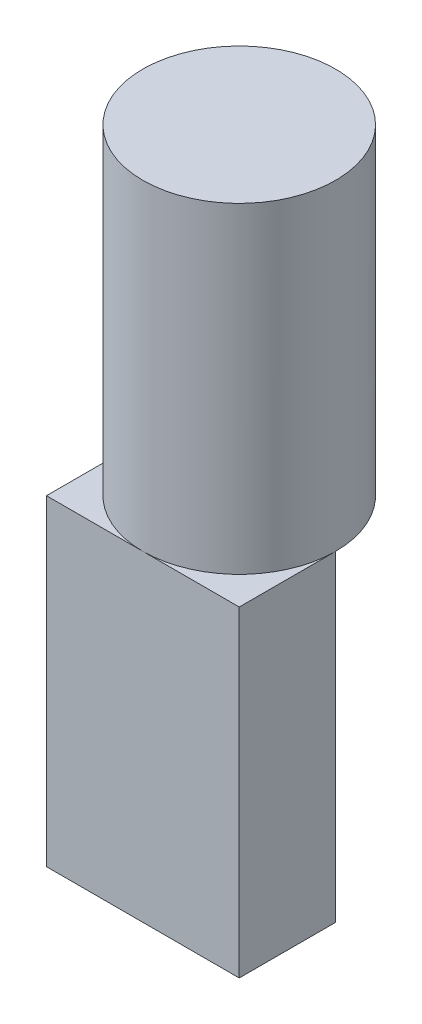
ISO-10303-21;
HEADER;
FILE_DESCRIPTION(('STEP AP214'),'2;1');
FILE_NAME('part.step','',(''),(''),'','','');
FILE_SCHEMA(('AUTOMOTIVE_DESIGN { 1 0 10303 214 1 1 1 1 }'));
ENDSEC;
DATA;
#1=APPLICATION_CONTEXT('core data for automotive mechanical design processes');
#2=APPLICATION_PROTOCOL_DEFINITION('international standard','automotive_design',2000,#1);
#3=PRODUCT_CONTEXT('',#1,'mechanical');
#4=PRODUCT('Part','Part','',(#3));
#5=PRODUCT_RELATED_PRODUCT_CATEGORY('part','',(#4));
#6=PRODUCT_DEFINITION_FORMATION('','',#4);
#7=PRODUCT_DEFINITION_CONTEXT('part definition',#1,'design');
#8=PRODUCT_DEFINITION('design','',#6,#7);
#9=PRODUCT_DEFINITION_SHAPE('','',#8);
#10=(LENGTH_UNIT() NAMED_UNIT(*) SI_UNIT(.MILLI.,.METRE.));
#11=(NAMED_UNIT(*) PLANE_ANGLE_UNIT() SI_UNIT($,.RADIAN.));
#12=(NAMED_UNIT(*) SI_UNIT($,.STERADIAN.) SOLID_ANGLE_UNIT());
#13=UNCERTAINTY_MEASURE_WITH_UNIT(LENGTH_MEASURE(1.E-05),#10,'distance_accuracy_value','');
#14=(GEOMETRIC_REPRESENTATION_CONTEXT(3) GLOBAL_UNCERTAINTY_ASSIGNED_CONTEXT((#13)) GLOBAL_UNIT_ASSIGNED_CONTEXT((#10,
#11,#12)) REPRESENTATION_CONTEXT('',''));
#15=CARTESIAN_POINT('',(0.,0.,0.));
#16=DIRECTION('',(0.,0.,1.));
#17=DIRECTION('',(1.,0.,0.));
#18=AXIS2_PLACEMENT_3D('',#15,#16,#17);
#19=CARTESIAN_POINT('',(0.,0.,0.));
#20=DIRECTION('',(0.,1.,0.));
#21=DIRECTION('',(0.,0.,1.));
#22=AXIS2_PLACEMENT_3D('',#19,#20,#21);
#23=PLANE('',#22);
#24=DIRECTION('',(1.,0.,0.));
#25=VECTOR('',#24,1.);
#26=CARTESIAN_POINT('',(-3.,0.,0.));
#27=LINE('',#26,#25);
#28=CARTESIAN_POINT('',(-3.,0.,0.));
#29=VERTEX_POINT('',#28);
#30=CARTESIAN_POINT('',(3.,0.,0.));
#31=VERTEX_POINT('',#30);
#32=EDGE_CURVE('E47',#29,#31,#27,.T.);
#33=ORIENTED_EDGE('',*,*,#32,.F.);
#34=CARTESIAN_POINT('',(0.,0.,0.));
#35=DIRECTION('',(0.,1.,0.));
#36=DIRECTION('',(0.,0.,1.));
#37=AXIS2_PLACEMENT_3D('',#34,#35,#36);
#38=CIRCLE('',#37,3.);
#39=EDGE_CURVE('E104',#31,#29,#38,.T.);
#40=ORIENTED_EDGE('',*,*,#39,.F.);
#41=EDGE_LOOP('',(#33,#40));
#42=FACE_BOUND('',#41,.T.);
#43=ADVANCED_FACE('F33',(#42),#23,.F.);
#44=CARTESIAN_POINT('',(0.,10.,0.));
#45=DIRECTION('',(0.,-1.,0.));
#46=DIRECTION('',(0.,0.,-1.));
#47=AXIS2_PLACEMENT_3D('',#44,#45,#46);
#48=CYLINDRICAL_SURFACE('',#47,3.);
#49=CARTESIAN_POINT('',(0.,10.,0.));
#50=DIRECTION('',(0.,1.,0.));
#51=DIRECTION('',(0.,0.,1.));
#52=AXIS2_PLACEMENT_3D('',#49,#50,#51);
#53=CIRCLE('',#52,3.);
#54=CARTESIAN_POINT('',(0.,10.,3.));
#55=VERTEX_POINT('',#54);
#56=EDGE_CURVE('E11',#55,#55,#53,.T.);
#57=ORIENTED_EDGE('',*,*,#56,.F.);
#58=EDGE_LOOP('',(#57));
#59=FACE_BOUND('',#58,.T.);
#60=CARTESIAN_POINT('',(0.,0.,3.));
#61=VERTEX_POINT('',#60);
#62=EDGE_CURVE('E37',#61,#31,#38,.T.);
#63=ORIENTED_EDGE('',*,*,#62,.T.);
#64=ORIENTED_EDGE('',*,*,#39,.T.);
#65=EDGE_CURVE('E54',#29,#61,#38,.T.);
#66=ORIENTED_EDGE('',*,*,#65,.T.);
#67=EDGE_LOOP('',(#63,#64,#66));
#68=FACE_BOUND('',#67,.T.);
#69=ADVANCED_FACE('F35',(#59,#68),#48,.T.);
#70=CARTESIAN_POINT('',(0.,10.,0.));
#71=DIRECTION('',(0.,1.,0.));
#72=DIRECTION('',(0.,0.,1.));
#73=AXIS2_PLACEMENT_3D('',#70,#71,#72);
#74=PLANE('',#73);
#75=ORIENTED_EDGE('',*,*,#56,.T.);
#76=EDGE_LOOP('',(#75));
#77=FACE_BOUND('',#76,.T.);
#78=ADVANCED_FACE('F136',(#77),#74,.T.);
#79=CARTESIAN_POINT('',(0.,0.,0.));
#80=DIRECTION('',(0.,-1.,0.));
#81=DIRECTION('',(0.,0.,-1.));
#82=AXIS2_PLACEMENT_3D('',#79,#80,#81);
#83=PLANE('',#82);
#84=ORIENTED_EDGE('',*,*,#62,.F.);
#85=DIRECTION('',(-1.,0.,0.));
#86=VECTOR('',#85,1.);
#87=CARTESIAN_POINT('',(3.,0.,3.));
#88=LINE('',#87,#86);
#89=CARTESIAN_POINT('',(3.,0.,3.));
#90=VERTEX_POINT('',#89);
#91=EDGE_CURVE('E98',#90,#61,#88,.T.);
#92=ORIENTED_EDGE('',*,*,#91,.F.);
#93=DIRECTION('',(0.,0.,1.));
#94=VECTOR('',#93,1.);
#95=CARTESIAN_POINT('',(3.,0.,0.));
#96=LINE('',#95,#94);
#97=EDGE_CURVE('E115',#31,#90,#96,.T.);
#98=ORIENTED_EDGE('',*,*,#97,.F.);
#99=EDGE_LOOP('',(#84,#92,#98));
#100=FACE_BOUND('',#99,.T.);
#101=ADVANCED_FACE('F131',(#100),#83,.F.);
#102=CARTESIAN_POINT('',(-3.,-10.,3.));
#103=DIRECTION('',(1.,0.,0.));
#104=DIRECTION('',(0.,0.,-1.));
#105=AXIS2_PLACEMENT_3D('',#102,#103,#104);
#106=PLANE('',#105);
#107=DIRECTION('',(0.,0.,-1.));
#108=VECTOR('',#107,1.);
#109=CARTESIAN_POINT('',(-3.,0.,3.));
#110=LINE('',#109,#108);
#111=CARTESIAN_POINT('',(-3.,0.,3.));
#112=VERTEX_POINT('',#111);
#113=EDGE_CURVE('E102',#112,#29,#110,.T.);
#114=ORIENTED_EDGE('',*,*,#113,.T.);
#115=DIRECTION('',(0.,1.,0.));
#116=VECTOR('',#115,1.);
#117=CARTESIAN_POINT('',(-3.,-10.,0.));
#118=LINE('',#117,#116);
#119=CARTESIAN_POINT('',(-3.,-10.,0.));
#120=VERTEX_POINT('',#119);
#121=EDGE_CURVE('E82',#120,#29,#118,.T.);
#122=ORIENTED_EDGE('',*,*,#121,.F.);
#123=DIRECTION('',(0.,0.,-1.));
#124=VECTOR('',#123,1.);
#125=CARTESIAN_POINT('',(-3.,-10.,3.));
#126=LINE('',#125,#124);
#127=CARTESIAN_POINT('',(-3.,-10.,3.));
#128=VERTEX_POINT('',#127);
#129=EDGE_CURVE('E89',#128,#120,#126,.T.);
#130=ORIENTED_EDGE('',*,*,#129,.F.);
#131=DIRECTION('',(0.,1.,0.));
#132=VECTOR('',#131,1.);
#133=CARTESIAN_POINT('',(-3.,-10.,3.));
#134=LINE('',#133,#132);
#135=EDGE_CURVE('E110',#128,#112,#134,.T.);
#136=ORIENTED_EDGE('',*,*,#135,.T.);
#137=EDGE_LOOP('',(#114,#122,#130,#136));
#138=FACE_BOUND('',#137,.T.);
#139=ADVANCED_FACE('F100',(#138),#106,.F.);
#140=CARTESIAN_POINT('',(-3.,-10.,0.));
#141=DIRECTION('',(0.,0.,1.));
#142=DIRECTION('',(1.,0.,0.));
#143=AXIS2_PLACEMENT_3D('',#140,#141,#142);
#144=PLANE('',#143);
#145=ORIENTED_EDGE('',*,*,#32,.T.);
#146=DIRECTION('',(0.,1.,0.));
#147=VECTOR('',#146,1.);
#148=CARTESIAN_POINT('',(3.,-10.,0.));
#149=LINE('',#148,#147);
#150=CARTESIAN_POINT('',(3.,-10.,0.));
#151=VERTEX_POINT('',#150);
#152=EDGE_CURVE('E85',#151,#31,#149,.T.);
#153=ORIENTED_EDGE('',*,*,#152,.F.);
#154=DIRECTION('',(1.,0.,0.));
#155=VECTOR('',#154,1.);
#156=CARTESIAN_POINT('',(-3.,-10.,0.));
#157=LINE('',#156,#155);
#158=EDGE_CURVE('E78',#120,#151,#157,.T.);
#159=ORIENTED_EDGE('',*,*,#158,.F.);
#160=ORIENTED_EDGE('',*,*,#121,.T.);
#161=EDGE_LOOP('',(#145,#153,#159,#160));
#162=FACE_BOUND('',#161,.T.);
#163=ADVANCED_FACE('F80',(#162),#144,.F.);
#164=CARTESIAN_POINT('',(3.,-10.,0.));
#165=DIRECTION('',(-1.,0.,0.));
#166=DIRECTION('',(0.,0.,1.));
#167=AXIS2_PLACEMENT_3D('',#164,#165,#166);
#168=PLANE('',#167);
#169=ORIENTED_EDGE('',*,*,#97,.T.);
#170=DIRECTION('',(0.,1.,0.));
#171=VECTOR('',#170,1.);
#172=CARTESIAN_POINT('',(3.,-10.,3.));
#173=LINE('',#172,#171);
#174=CARTESIAN_POINT('',(3.,-10.,3.));
#175=VERTEX_POINT('',#174);
#176=EDGE_CURVE('E105',#175,#90,#173,.T.);
#177=ORIENTED_EDGE('',*,*,#176,.F.);
#178=DIRECTION('',(0.,0.,1.));
#179=VECTOR('',#178,1.);
#180=CARTESIAN_POINT('',(3.,-10.,0.));
#181=LINE('',#180,#179);
#182=EDGE_CURVE('E88',#151,#175,#181,.T.);
#183=ORIENTED_EDGE('',*,*,#182,.F.);
#184=ORIENTED_EDGE('',*,*,#152,.T.);
#185=EDGE_LOOP('',(#169,#177,#183,#184));
#186=FACE_BOUND('',#185,.T.);
#187=ADVANCED_FACE('F122',(#186),#168,.F.);
#188=CARTESIAN_POINT('',(3.,-10.,3.));
#189=DIRECTION('',(0.,0.,-1.));
#190=DIRECTION('',(-1.,0.,0.));
#191=AXIS2_PLACEMENT_3D('',#188,#189,#190);
#192=PLANE('',#191);
#193=ORIENTED_EDGE('',*,*,#91,.T.);
#194=EDGE_CURVE('E114',#61,#112,#88,.T.);
#195=ORIENTED_EDGE('',*,*,#194,.T.);
#196=ORIENTED_EDGE('',*,*,#135,.F.);
#197=DIRECTION('',(-1.,0.,0.));
#198=VECTOR('',#197,1.);
#199=CARTESIAN_POINT('',(3.,-10.,3.));
#200=LINE('',#199,#198);
#201=EDGE_CURVE('E94',#175,#128,#200,.T.);
#202=ORIENTED_EDGE('',*,*,#201,.F.);
#203=ORIENTED_EDGE('',*,*,#176,.T.);
#204=EDGE_LOOP('',(#193,#195,#196,#202,#203));
#205=FACE_BOUND('',#204,.T.);
#206=ADVANCED_FACE('F126',(#205),#192,.F.);
#207=CARTESIAN_POINT('',(0.,-10.,0.));
#208=DIRECTION('',(0.,-1.,0.));
#209=DIRECTION('',(0.,0.,-1.));
#210=AXIS2_PLACEMENT_3D('',#207,#208,#209);
#211=PLANE('',#210);
#212=ORIENTED_EDGE('',*,*,#129,.T.);
#213=ORIENTED_EDGE('',*,*,#158,.T.);
#214=ORIENTED_EDGE('',*,*,#182,.T.);
#215=ORIENTED_EDGE('',*,*,#201,.T.);
#216=EDGE_LOOP('',(#212,#213,#214,#215));
#217=FACE_BOUND('',#216,.T.);
#218=ADVANCED_FACE('F92',(#217),#211,.T.);
#219=ORIENTED_EDGE('',*,*,#65,.F.);
#220=ORIENTED_EDGE('',*,*,#113,.F.);
#221=ORIENTED_EDGE('',*,*,#194,.F.);
#222=EDGE_LOOP('',(#219,#220,#221));
#223=FACE_BOUND('',#222,.T.);
#224=ADVANCED_FACE('F129',(#223),#83,.F.);
#225=CLOSED_SHELL('',(#43,#69,#78,#101,#139,#163,#187,#206,#218,#224));
#226=MANIFOLD_SOLID_BREP('B2',#225);
#227=ADVANCED_BREP_SHAPE_REPRESENTATION('',(#18,#226),#14);
#228=SHAPE_DEFINITION_REPRESENTATION(#9,#227);
ENDSEC;
END-ISO-10303-21;
